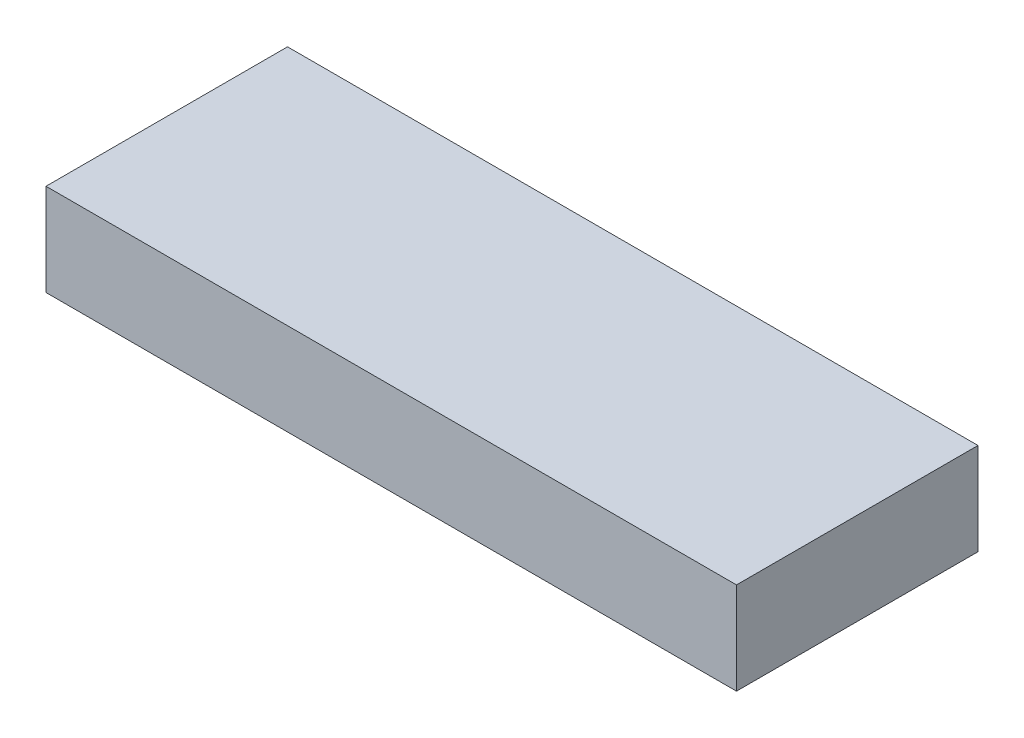
ISO-10303-21;
HEADER;
FILE_DESCRIPTION(('STEP AP214'),'2;1');
FILE_NAME('part.step','',(''),(''),'','','');
FILE_SCHEMA(('AUTOMOTIVE_DESIGN { 1 0 10303 214 1 1 1 1 }'));
ENDSEC;
DATA;
#1=APPLICATION_CONTEXT('core data for automotive mechanical design processes');
#2=APPLICATION_PROTOCOL_DEFINITION('international standard','automotive_design',2000,#1);
#3=PRODUCT_CONTEXT('',#1,'mechanical');
#4=PRODUCT('Part','Part','',(#3));
#5=PRODUCT_RELATED_PRODUCT_CATEGORY('part','',(#4));
#6=PRODUCT_DEFINITION_FORMATION('','',#4);
#7=PRODUCT_DEFINITION_CONTEXT('part definition',#1,'design');
#8=PRODUCT_DEFINITION('design','',#6,#7);
#9=PRODUCT_DEFINITION_SHAPE('','',#8);
#10=(LENGTH_UNIT() NAMED_UNIT(*) SI_UNIT(.MILLI.,.METRE.));
#11=(NAMED_UNIT(*) PLANE_ANGLE_UNIT() SI_UNIT($,.RADIAN.));
#12=(NAMED_UNIT(*) SI_UNIT($,.STERADIAN.) SOLID_ANGLE_UNIT());
#13=UNCERTAINTY_MEASURE_WITH_UNIT(LENGTH_MEASURE(1.E-05),#10,'distance_accuracy_value','');
#14=(GEOMETRIC_REPRESENTATION_CONTEXT(3) GLOBAL_UNCERTAINTY_ASSIGNED_CONTEXT((#13)) GLOBAL_UNIT_ASSIGNED_CONTEXT((#10,
#11,#12)) REPRESENTATION_CONTEXT('',''));
#15=CARTESIAN_POINT('',(0.,0.,0.));
#16=DIRECTION('',(0.,0.,1.));
#17=DIRECTION('',(1.,0.,0.));
#18=AXIS2_PLACEMENT_3D('',#15,#16,#17);
#19=CARTESIAN_POINT('',(0.,6.35,0.));
#20=DIRECTION('',(1.,0.,0.));
#21=DIRECTION('',(0.,0.,-1.));
#22=AXIS2_PLACEMENT_3D('',#19,#20,#21);
#23=PLANE('',#22);
#24=DIRECTION('',(0.,0.,1.));
#25=VECTOR('',#24,1.);
#26=CARTESIAN_POINT('',(0.,0.,0.));
#27=LINE('',#26,#25);
#28=CARTESIAN_POINT('',(0.,0.,-16.66));
#29=VERTEX_POINT('',#28);
#30=CARTESIAN_POINT('',(0.,0.,0.));
#31=VERTEX_POINT('',#30);
#32=EDGE_CURVE('E96',#29,#31,#27,.T.);
#33=ORIENTED_EDGE('',*,*,#32,.T.);
#34=DIRECTION('',(0.,-1.,0.));
#35=VECTOR('',#34,1.);
#36=CARTESIAN_POINT('',(0.,6.35,0.));
#37=LINE('',#36,#35);
#38=CARTESIAN_POINT('',(0.,6.35,0.));
#39=VERTEX_POINT('',#38);
#40=EDGE_CURVE('E11',#39,#31,#37,.T.);
#41=ORIENTED_EDGE('',*,*,#40,.F.);
#42=DIRECTION('',(0.,0.,1.));
#43=VECTOR('',#42,1.);
#44=CARTESIAN_POINT('',(0.,6.35,0.));
#45=LINE('',#44,#43);
#46=CARTESIAN_POINT('',(0.,6.35,-16.66));
#47=VERTEX_POINT('',#46);
#48=EDGE_CURVE('E84',#47,#39,#45,.T.);
#49=ORIENTED_EDGE('',*,*,#48,.F.);
#50=DIRECTION('',(0.,-1.,0.));
#51=VECTOR('',#50,1.);
#52=CARTESIAN_POINT('',(0.,6.35,-16.66));
#53=LINE('',#52,#51);
#54=EDGE_CURVE('E92',#47,#29,#53,.T.);
#55=ORIENTED_EDGE('',*,*,#54,.T.);
#56=EDGE_LOOP('',(#33,#41,#49,#55));
#57=FACE_BOUND('',#56,.T.);
#58=ADVANCED_FACE('F33',(#57),#23,.F.);
#59=CARTESIAN_POINT('',(0.,6.35,0.));
#60=DIRECTION('',(0.,0.,-1.));
#61=DIRECTION('',(-1.,0.,0.));
#62=AXIS2_PLACEMENT_3D('',#59,#60,#61);
#63=PLANE('',#62);
#64=DIRECTION('',(1.,0.,0.));
#65=VECTOR('',#64,1.);
#66=CARTESIAN_POINT('',(0.,0.,0.));
#67=LINE('',#66,#65);
#68=CARTESIAN_POINT('',(47.63,0.,0.));
#69=VERTEX_POINT('',#68);
#70=EDGE_CURVE('E88',#31,#69,#67,.T.);
#71=ORIENTED_EDGE('',*,*,#70,.T.);
#72=DIRECTION('',(0.,-1.,0.));
#73=VECTOR('',#72,1.);
#74=CARTESIAN_POINT('',(47.63,6.35,0.));
#75=LINE('',#74,#73);
#76=CARTESIAN_POINT('',(47.63,6.35,0.));
#77=VERTEX_POINT('',#76);
#78=EDGE_CURVE('E41',#77,#69,#75,.T.);
#79=ORIENTED_EDGE('',*,*,#78,.F.);
#80=DIRECTION('',(1.,0.,0.));
#81=VECTOR('',#80,1.);
#82=CARTESIAN_POINT('',(0.,6.35,0.));
#83=LINE('',#82,#81);
#84=EDGE_CURVE('E79',#39,#77,#83,.T.);
#85=ORIENTED_EDGE('',*,*,#84,.F.);
#86=ORIENTED_EDGE('',*,*,#40,.T.);
#87=EDGE_LOOP('',(#71,#79,#85,#86));
#88=FACE_BOUND('',#87,.T.);
#89=ADVANCED_FACE('F87',(#88),#63,.F.);
#90=CARTESIAN_POINT('',(47.63,6.35,0.));
#91=DIRECTION('',(-1.,0.,0.));
#92=DIRECTION('',(0.,0.,1.));
#93=AXIS2_PLACEMENT_3D('',#90,#91,#92);
#94=PLANE('',#93);
#95=DIRECTION('',(0.,0.,-1.));
#96=VECTOR('',#95,1.);
#97=CARTESIAN_POINT('',(47.63,0.,0.));
#98=LINE('',#97,#96);
#99=CARTESIAN_POINT('',(47.63,0.,-16.66));
#100=VERTEX_POINT('',#99);
#101=EDGE_CURVE('E66',#69,#100,#98,.T.);
#102=ORIENTED_EDGE('',*,*,#101,.T.);
#103=DIRECTION('',(0.,-1.,0.));
#104=VECTOR('',#103,1.);
#105=CARTESIAN_POINT('',(47.63,6.35,-16.66));
#106=LINE('',#105,#104);
#107=CARTESIAN_POINT('',(47.63,6.35,-16.66));
#108=VERTEX_POINT('',#107);
#109=EDGE_CURVE('E89',#108,#100,#106,.T.);
#110=ORIENTED_EDGE('',*,*,#109,.F.);
#111=DIRECTION('',(0.,0.,-1.));
#112=VECTOR('',#111,1.);
#113=CARTESIAN_POINT('',(47.63,6.35,0.));
#114=LINE('',#113,#112);
#115=EDGE_CURVE('E82',#77,#108,#114,.T.);
#116=ORIENTED_EDGE('',*,*,#115,.F.);
#117=ORIENTED_EDGE('',*,*,#78,.T.);
#118=EDGE_LOOP('',(#102,#110,#116,#117));
#119=FACE_BOUND('',#118,.T.);
#120=ADVANCED_FACE('F90',(#119),#94,.F.);
#121=CARTESIAN_POINT('',(0.,6.35,-16.66));
#122=DIRECTION('',(0.,0.,1.));
#123=DIRECTION('',(1.,0.,0.));
#124=AXIS2_PLACEMENT_3D('',#121,#122,#123);
#125=PLANE('',#124);
#126=DIRECTION('',(-1.,0.,0.));
#127=VECTOR('',#126,1.);
#128=CARTESIAN_POINT('',(0.,0.,-16.66));
#129=LINE('',#128,#127);
#130=EDGE_CURVE('E72',#100,#29,#129,.T.);
#131=ORIENTED_EDGE('',*,*,#130,.T.);
#132=ORIENTED_EDGE('',*,*,#54,.F.);
#133=DIRECTION('',(-1.,0.,0.));
#134=VECTOR('',#133,1.);
#135=CARTESIAN_POINT('',(0.,6.35,-16.66));
#136=LINE('',#135,#134);
#137=EDGE_CURVE('E49',#108,#47,#136,.T.);
#138=ORIENTED_EDGE('',*,*,#137,.F.);
#139=ORIENTED_EDGE('',*,*,#109,.T.);
#140=EDGE_LOOP('',(#131,#132,#138,#139));
#141=FACE_BOUND('',#140,.T.);
#142=ADVANCED_FACE('F103',(#141),#125,.F.);
#143=CARTESIAN_POINT('',(0.,6.35,0.));
#144=DIRECTION('',(0.,-1.,0.));
#145=DIRECTION('',(0.,0.,-1.));
#146=AXIS2_PLACEMENT_3D('',#143,#144,#145);
#147=PLANE('',#146);
#148=ORIENTED_EDGE('',*,*,#48,.T.);
#149=ORIENTED_EDGE('',*,*,#84,.T.);
#150=ORIENTED_EDGE('',*,*,#115,.T.);
#151=ORIENTED_EDGE('',*,*,#137,.T.);
#152=EDGE_LOOP('',(#148,#149,#150,#151));
#153=FACE_BOUND('',#152,.T.);
#154=ADVANCED_FACE('F80',(#153),#147,.F.);
#155=CARTESIAN_POINT('',(0.,0.,0.));
#156=DIRECTION('',(0.,-1.,0.));
#157=DIRECTION('',(0.,0.,-1.));
#158=AXIS2_PLACEMENT_3D('',#155,#156,#157);
#159=PLANE('',#158);
#160=ORIENTED_EDGE('',*,*,#32,.F.);
#161=ORIENTED_EDGE('',*,*,#130,.F.);
#162=ORIENTED_EDGE('',*,*,#101,.F.);
#163=ORIENTED_EDGE('',*,*,#70,.F.);
#164=EDGE_LOOP('',(#160,#161,#162,#163));
#165=FACE_BOUND('',#164,.T.);
#166=ADVANCED_FACE('F106',(#165),#159,.T.);
#167=CLOSED_SHELL('',(#58,#89,#120,#142,#154,#166));
#168=MANIFOLD_SOLID_BREP('B2',#167);
#169=ADVANCED_BREP_SHAPE_REPRESENTATION('',(#18,#168),#14);
#170=SHAPE_DEFINITION_REPRESENTATION(#9,#169);
ENDSEC;
END-ISO-10303-21;
